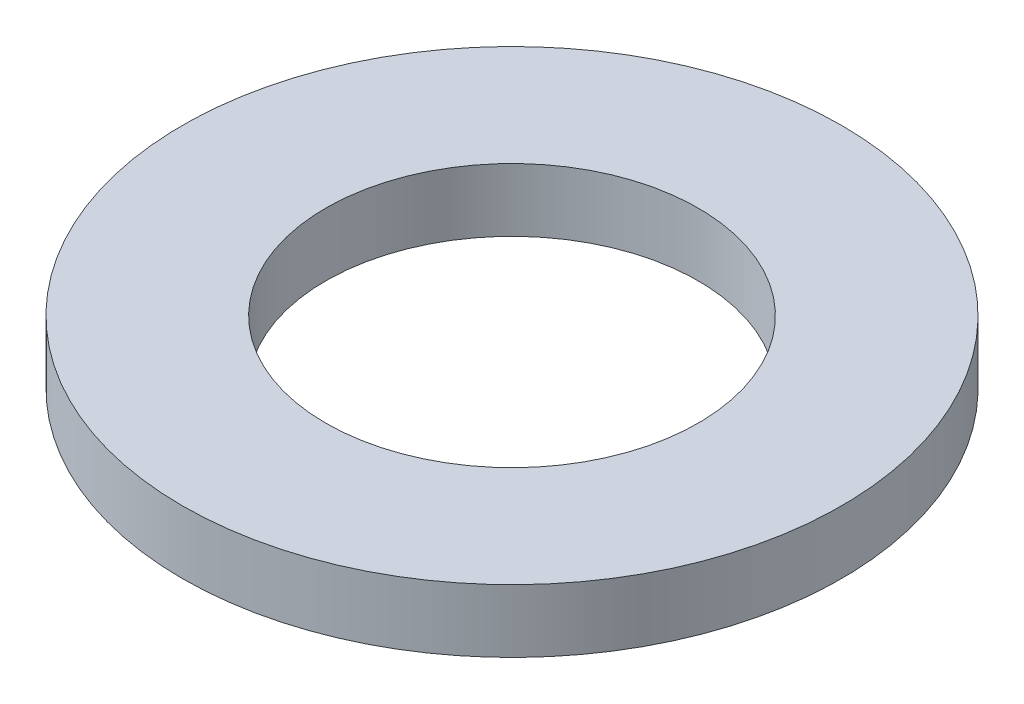
ISO-10303-21;
HEADER;
FILE_DESCRIPTION(('STEP AP214'),'2;1');
FILE_NAME('part.step','',(''),(''),'','','');
FILE_SCHEMA(('AUTOMOTIVE_DESIGN { 1 0 10303 214 1 1 1 1 }'));
ENDSEC;
DATA;
#1=APPLICATION_CONTEXT('core data for automotive mechanical design processes');
#2=APPLICATION_PROTOCOL_DEFINITION('international standard','automotive_design',2000,#1);
#3=PRODUCT_CONTEXT('',#1,'mechanical');
#4=PRODUCT('Part','Part','',(#3));
#5=PRODUCT_RELATED_PRODUCT_CATEGORY('part','',(#4));
#6=PRODUCT_DEFINITION_FORMATION('','',#4);
#7=PRODUCT_DEFINITION_CONTEXT('part definition',#1,'design');
#8=PRODUCT_DEFINITION('design','',#6,#7);
#9=PRODUCT_DEFINITION_SHAPE('','',#8);
#10=(LENGTH_UNIT() NAMED_UNIT(*) SI_UNIT(.MILLI.,.METRE.));
#11=(NAMED_UNIT(*) PLANE_ANGLE_UNIT() SI_UNIT($,.RADIAN.));
#12=(NAMED_UNIT(*) SI_UNIT($,.STERADIAN.) SOLID_ANGLE_UNIT());
#13=UNCERTAINTY_MEASURE_WITH_UNIT(LENGTH_MEASURE(1.E-05),#10,'distance_accuracy_value','');
#14=(GEOMETRIC_REPRESENTATION_CONTEXT(3) GLOBAL_UNCERTAINTY_ASSIGNED_CONTEXT((#13)) GLOBAL_UNIT_ASSIGNED_CONTEXT((#10,
#11,#12)) REPRESENTATION_CONTEXT('',''));
#15=CARTESIAN_POINT('',(0.,0.,0.));
#16=DIRECTION('',(0.,0.,1.));
#17=DIRECTION('',(1.,0.,0.));
#18=AXIS2_PLACEMENT_3D('',#15,#16,#17);
#19=CARTESIAN_POINT('',(0.,11.,0.));
#20=DIRECTION('',(0.,-1.,0.));
#21=DIRECTION('',(0.,0.,-1.));
#22=AXIS2_PLACEMENT_3D('',#19,#20,#21);
#23=CYLINDRICAL_SURFACE('',#22,57.5);
#24=CARTESIAN_POINT('',(0.,11.,0.));
#25=DIRECTION('',(0.,1.,0.));
#26=DIRECTION('',(0.,0.,1.));
#27=AXIS2_PLACEMENT_3D('',#24,#25,#26);
#28=CIRCLE('',#27,57.5);
#29=CARTESIAN_POINT('',(0.,11.,57.5));
#30=VERTEX_POINT('',#29);
#31=EDGE_CURVE('E10',#30,#30,#28,.T.);
#32=ORIENTED_EDGE('',*,*,#31,.F.);
#33=EDGE_LOOP('',(#32));
#34=FACE_BOUND('',#33,.T.);
#35=CARTESIAN_POINT('',(0.,0.,0.));
#36=DIRECTION('',(0.,1.,0.));
#37=DIRECTION('',(0.,0.,1.));
#38=AXIS2_PLACEMENT_3D('',#35,#36,#37);
#39=CIRCLE('',#38,57.5);
#40=CARTESIAN_POINT('',(0.,0.,57.5));
#41=VERTEX_POINT('',#40);
#42=EDGE_CURVE('E37',#41,#41,#39,.T.);
#43=ORIENTED_EDGE('',*,*,#42,.T.);
#44=EDGE_LOOP('',(#43));
#45=FACE_BOUND('',#44,.T.);
#46=ADVANCED_FACE('F40',(#34,#45),#23,.T.);
#47=CARTESIAN_POINT('',(0.,11.,0.));
#48=DIRECTION('',(0.,1.,0.));
#49=DIRECTION('',(0.,0.,1.));
#50=AXIS2_PLACEMENT_3D('',#47,#48,#49);
#51=PLANE('',#50);
#52=CARTESIAN_POINT('',(0.,11.,0.));
#53=DIRECTION('',(0.,1.,0.));
#54=DIRECTION('',(0.,0.,1.));
#55=AXIS2_PLACEMENT_3D('',#52,#53,#54);
#56=CIRCLE('',#55,32.5);
#57=CARTESIAN_POINT('',(0.,11.,32.5));
#58=VERTEX_POINT('',#57);
#59=EDGE_CURVE('E50',#58,#58,#56,.T.);
#60=ORIENTED_EDGE('',*,*,#59,.F.);
#61=EDGE_LOOP('',(#60));
#62=FACE_BOUND('',#61,.T.);
#63=ORIENTED_EDGE('',*,*,#31,.T.);
#64=EDGE_LOOP('',(#63));
#65=FACE_BOUND('',#64,.T.);
#66=ADVANCED_FACE('F59',(#62,#65),#51,.T.);
#67=CARTESIAN_POINT('',(0.,0.,0.));
#68=DIRECTION('',(0.,1.,0.));
#69=DIRECTION('',(0.,0.,1.));
#70=AXIS2_PLACEMENT_3D('',#67,#68,#69);
#71=PLANE('',#70);
#72=CARTESIAN_POINT('',(0.,0.,0.));
#73=DIRECTION('',(0.,1.,0.));
#74=DIRECTION('',(0.,0.,1.));
#75=AXIS2_PLACEMENT_3D('',#72,#73,#74);
#76=CIRCLE('',#75,32.5);
#77=CARTESIAN_POINT('',(0.,0.,32.5));
#78=VERTEX_POINT('',#77);
#79=EDGE_CURVE('E47',#78,#78,#76,.T.);
#80=ORIENTED_EDGE('',*,*,#79,.T.);
#81=EDGE_LOOP('',(#80));
#82=FACE_BOUND('',#81,.T.);
#83=ORIENTED_EDGE('',*,*,#42,.F.);
#84=EDGE_LOOP('',(#83));
#85=FACE_BOUND('',#84,.T.);
#86=ADVANCED_FACE('F58',(#82,#85),#71,.F.);
#87=CARTESIAN_POINT('',(0.,11.,0.));
#88=DIRECTION('',(0.,-1.,0.));
#89=DIRECTION('',(0.,0.,-1.));
#90=AXIS2_PLACEMENT_3D('',#87,#88,#89);
#91=CYLINDRICAL_SURFACE('',#90,32.5);
#92=ORIENTED_EDGE('',*,*,#59,.T.);
#93=EDGE_LOOP('',(#92));
#94=FACE_BOUND('',#93,.T.);
#95=ORIENTED_EDGE('',*,*,#79,.F.);
#96=EDGE_LOOP('',(#95));
#97=FACE_BOUND('',#96,.T.);
#98=ADVANCED_FACE('F54',(#94,#97),#91,.F.);
#99=CLOSED_SHELL('',(#46,#66,#86,#98));
#100=MANIFOLD_SOLID_BREP('B2',#99);
#101=ADVANCED_BREP_SHAPE_REPRESENTATION('',(#18,#100),#14);
#102=SHAPE_DEFINITION_REPRESENTATION(#9,#101);
ENDSEC;
END-ISO-10303-21;
